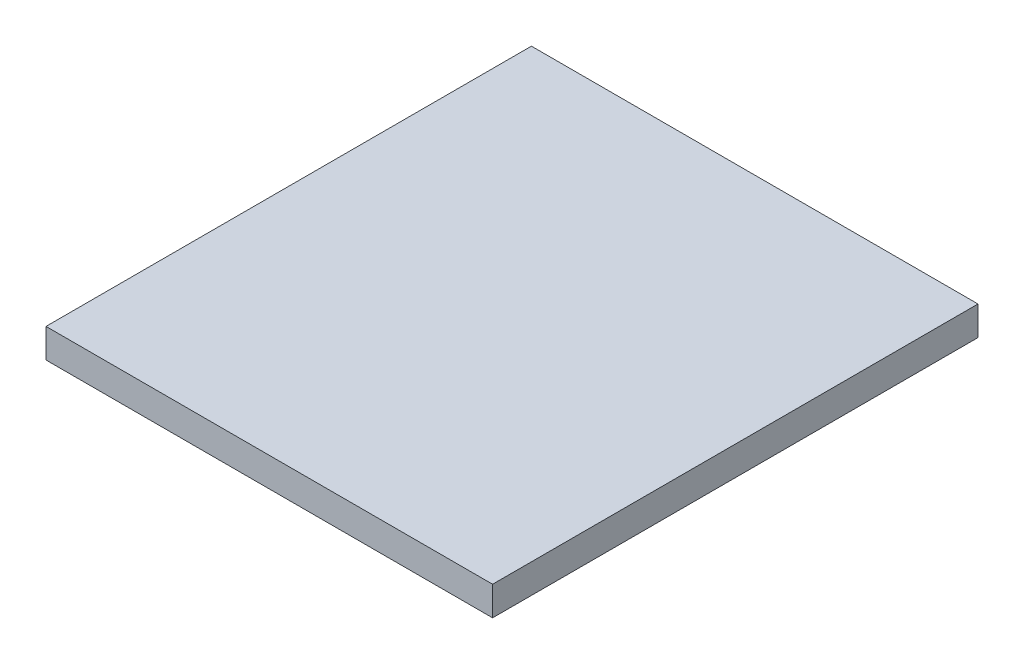
ISO-10303-21;
HEADER;
FILE_DESCRIPTION(('STEP AP214'),'2;1');
FILE_NAME('part.step','',(''),(''),'','','');
FILE_SCHEMA(('AUTOMOTIVE_DESIGN { 1 0 10303 214 1 1 1 1 }'));
ENDSEC;
DATA;
#1=APPLICATION_CONTEXT('core data for automotive mechanical design processes');
#2=APPLICATION_PROTOCOL_DEFINITION('international standard','automotive_design',2000,#1);
#3=PRODUCT_CONTEXT('',#1,'mechanical');
#4=PRODUCT('Part','Part','',(#3));
#5=PRODUCT_RELATED_PRODUCT_CATEGORY('part','',(#4));
#6=PRODUCT_DEFINITION_FORMATION('','',#4);
#7=PRODUCT_DEFINITION_CONTEXT('part definition',#1,'design');
#8=PRODUCT_DEFINITION('design','',#6,#7);
#9=PRODUCT_DEFINITION_SHAPE('','',#8);
#10=(LENGTH_UNIT() NAMED_UNIT(*) SI_UNIT(.MILLI.,.METRE.));
#11=(NAMED_UNIT(*) PLANE_ANGLE_UNIT() SI_UNIT($,.RADIAN.));
#12=(NAMED_UNIT(*) SI_UNIT($,.STERADIAN.) SOLID_ANGLE_UNIT());
#13=UNCERTAINTY_MEASURE_WITH_UNIT(LENGTH_MEASURE(1.E-05),#10,'distance_accuracy_value','');
#14=(GEOMETRIC_REPRESENTATION_CONTEXT(3) GLOBAL_UNCERTAINTY_ASSIGNED_CONTEXT((#13)) GLOBAL_UNIT_ASSIGNED_CONTEXT((#10,
#11,#12)) REPRESENTATION_CONTEXT('',''));
#15=CARTESIAN_POINT('',(0.,0.,0.));
#16=DIRECTION('',(0.,0.,1.));
#17=DIRECTION('',(1.,0.,0.));
#18=AXIS2_PLACEMENT_3D('',#15,#16,#17);
#19=CARTESIAN_POINT('',(23.,3.,-25.));
#20=DIRECTION('',(-1.,0.,0.));
#21=DIRECTION('',(0.,0.,1.));
#22=AXIS2_PLACEMENT_3D('',#19,#20,#21);
#23=PLANE('',#22);
#24=DIRECTION('',(0.,0.,-1.));
#25=VECTOR('',#24,1.);
#26=CARTESIAN_POINT('',(23.,0.,-25.));
#27=LINE('',#26,#25);
#28=CARTESIAN_POINT('',(23.,0.,25.));
#29=VERTEX_POINT('',#28);
#30=CARTESIAN_POINT('',(23.,0.,-25.));
#31=VERTEX_POINT('',#30);
#32=EDGE_CURVE('E95',#29,#31,#27,.T.);
#33=ORIENTED_EDGE('',*,*,#32,.T.);
#34=DIRECTION('',(0.,-1.,0.));
#35=VECTOR('',#34,1.);
#36=CARTESIAN_POINT('',(23.,3.,-25.));
#37=LINE('',#36,#35);
#38=CARTESIAN_POINT('',(23.,3.,-25.));
#39=VERTEX_POINT('',#38);
#40=EDGE_CURVE('E11',#39,#31,#37,.T.);
#41=ORIENTED_EDGE('',*,*,#40,.F.);
#42=DIRECTION('',(0.,0.,-1.));
#43=VECTOR('',#42,1.);
#44=CARTESIAN_POINT('',(23.,3.,-25.));
#45=LINE('',#44,#43);
#46=CARTESIAN_POINT('',(23.,3.,25.));
#47=VERTEX_POINT('',#46);
#48=EDGE_CURVE('E83',#47,#39,#45,.T.);
#49=ORIENTED_EDGE('',*,*,#48,.F.);
#50=DIRECTION('',(0.,-1.,0.));
#51=VECTOR('',#50,1.);
#52=CARTESIAN_POINT('',(23.,3.,25.));
#53=LINE('',#52,#51);
#54=EDGE_CURVE('E91',#47,#29,#53,.T.);
#55=ORIENTED_EDGE('',*,*,#54,.T.);
#56=EDGE_LOOP('',(#33,#41,#49,#55));
#57=FACE_BOUND('',#56,.T.);
#58=ADVANCED_FACE('F32',(#57),#23,.F.);
#59=CARTESIAN_POINT('',(-23.,3.,-25.));
#60=DIRECTION('',(0.,0.,1.));
#61=DIRECTION('',(1.,0.,0.));
#62=AXIS2_PLACEMENT_3D('',#59,#60,#61);
#63=PLANE('',#62);
#64=DIRECTION('',(-1.,0.,0.));
#65=VECTOR('',#64,1.);
#66=CARTESIAN_POINT('',(-23.,0.,-25.));
#67=LINE('',#66,#65);
#68=CARTESIAN_POINT('',(-23.,0.,-25.));
#69=VERTEX_POINT('',#68);
#70=EDGE_CURVE('E87',#31,#69,#67,.T.);
#71=ORIENTED_EDGE('',*,*,#70,.T.);
#72=DIRECTION('',(0.,-1.,0.));
#73=VECTOR('',#72,1.);
#74=CARTESIAN_POINT('',(-23.,3.,-25.));
#75=LINE('',#74,#73);
#76=CARTESIAN_POINT('',(-23.,3.,-25.));
#77=VERTEX_POINT('',#76);
#78=EDGE_CURVE('E40',#77,#69,#75,.T.);
#79=ORIENTED_EDGE('',*,*,#78,.F.);
#80=DIRECTION('',(-1.,0.,0.));
#81=VECTOR('',#80,1.);
#82=CARTESIAN_POINT('',(-23.,3.,-25.));
#83=LINE('',#82,#81);
#84=EDGE_CURVE('E78',#39,#77,#83,.T.);
#85=ORIENTED_EDGE('',*,*,#84,.F.);
#86=ORIENTED_EDGE('',*,*,#40,.T.);
#87=EDGE_LOOP('',(#71,#79,#85,#86));
#88=FACE_BOUND('',#87,.T.);
#89=ADVANCED_FACE('F86',(#88),#63,.F.);
#90=CARTESIAN_POINT('',(-23.,3.,-25.));
#91=DIRECTION('',(1.,0.,0.));
#92=DIRECTION('',(0.,0.,-1.));
#93=AXIS2_PLACEMENT_3D('',#90,#91,#92);
#94=PLANE('',#93);
#95=DIRECTION('',(0.,0.,1.));
#96=VECTOR('',#95,1.);
#97=CARTESIAN_POINT('',(-23.,0.,-25.));
#98=LINE('',#97,#96);
#99=CARTESIAN_POINT('',(-23.,0.,25.));
#100=VERTEX_POINT('',#99);
#101=EDGE_CURVE('E65',#69,#100,#98,.T.);
#102=ORIENTED_EDGE('',*,*,#101,.T.);
#103=DIRECTION('',(0.,-1.,0.));
#104=VECTOR('',#103,1.);
#105=CARTESIAN_POINT('',(-23.,3.,25.));
#106=LINE('',#105,#104);
#107=CARTESIAN_POINT('',(-23.,3.,25.));
#108=VERTEX_POINT('',#107);
#109=EDGE_CURVE('E88',#108,#100,#106,.T.);
#110=ORIENTED_EDGE('',*,*,#109,.F.);
#111=DIRECTION('',(0.,0.,1.));
#112=VECTOR('',#111,1.);
#113=CARTESIAN_POINT('',(-23.,3.,-25.));
#114=LINE('',#113,#112);
#115=EDGE_CURVE('E81',#77,#108,#114,.T.);
#116=ORIENTED_EDGE('',*,*,#115,.F.);
#117=ORIENTED_EDGE('',*,*,#78,.T.);
#118=EDGE_LOOP('',(#102,#110,#116,#117));
#119=FACE_BOUND('',#118,.T.);
#120=ADVANCED_FACE('F89',(#119),#94,.F.);
#121=CARTESIAN_POINT('',(-23.,3.,25.));
#122=DIRECTION('',(0.,0.,-1.));
#123=DIRECTION('',(-1.,0.,0.));
#124=AXIS2_PLACEMENT_3D('',#121,#122,#123);
#125=PLANE('',#124);
#126=DIRECTION('',(1.,0.,0.));
#127=VECTOR('',#126,1.);
#128=CARTESIAN_POINT('',(-23.,0.,25.));
#129=LINE('',#128,#127);
#130=EDGE_CURVE('E71',#100,#29,#129,.T.);
#131=ORIENTED_EDGE('',*,*,#130,.T.);
#132=ORIENTED_EDGE('',*,*,#54,.F.);
#133=DIRECTION('',(1.,0.,0.));
#134=VECTOR('',#133,1.);
#135=CARTESIAN_POINT('',(-23.,3.,25.));
#136=LINE('',#135,#134);
#137=EDGE_CURVE('E48',#108,#47,#136,.T.);
#138=ORIENTED_EDGE('',*,*,#137,.F.);
#139=ORIENTED_EDGE('',*,*,#109,.T.);
#140=EDGE_LOOP('',(#131,#132,#138,#139));
#141=FACE_BOUND('',#140,.T.);
#142=ADVANCED_FACE('F102',(#141),#125,.F.);
#143=CARTESIAN_POINT('',(0.,3.,0.));
#144=DIRECTION('',(0.,1.,0.));
#145=DIRECTION('',(0.,0.,1.));
#146=AXIS2_PLACEMENT_3D('',#143,#144,#145);
#147=PLANE('',#146);
#148=ORIENTED_EDGE('',*,*,#48,.T.);
#149=ORIENTED_EDGE('',*,*,#84,.T.);
#150=ORIENTED_EDGE('',*,*,#115,.T.);
#151=ORIENTED_EDGE('',*,*,#137,.T.);
#152=EDGE_LOOP('',(#148,#149,#150,#151));
#153=FACE_BOUND('',#152,.T.);
#154=ADVANCED_FACE('F79',(#153),#147,.T.);
#155=CARTESIAN_POINT('',(0.,0.,0.));
#156=DIRECTION('',(0.,1.,0.));
#157=DIRECTION('',(0.,0.,1.));
#158=AXIS2_PLACEMENT_3D('',#155,#156,#157);
#159=PLANE('',#158);
#160=ORIENTED_EDGE('',*,*,#32,.F.);
#161=ORIENTED_EDGE('',*,*,#130,.F.);
#162=ORIENTED_EDGE('',*,*,#101,.F.);
#163=ORIENTED_EDGE('',*,*,#70,.F.);
#164=EDGE_LOOP('',(#160,#161,#162,#163));
#165=FACE_BOUND('',#164,.T.);
#166=ADVANCED_FACE('F105',(#165),#159,.F.);
#167=CLOSED_SHELL('',(#58,#89,#120,#142,#154,#166));
#168=MANIFOLD_SOLID_BREP('B2',#167);
#169=ADVANCED_BREP_SHAPE_REPRESENTATION('',(#18,#168),#14);
#170=SHAPE_DEFINITION_REPRESENTATION(#9,#169);
ENDSEC;
END-ISO-10303-21;
